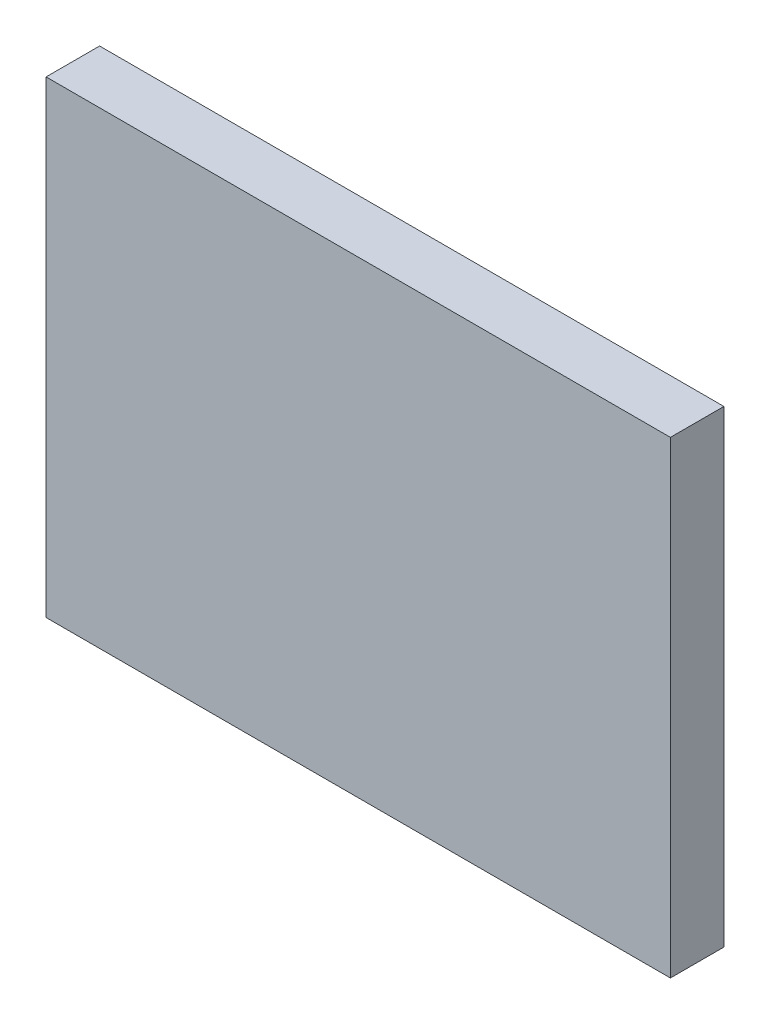
ISO-10303-21;
HEADER;
FILE_DESCRIPTION(('STEP AP214'),'2;1');
FILE_NAME('part.step','',(''),(''),'','','');
FILE_SCHEMA(('AUTOMOTIVE_DESIGN { 1 0 10303 214 1 1 1 1 }'));
ENDSEC;
DATA;
#1=APPLICATION_CONTEXT('core data for automotive mechanical design processes');
#2=APPLICATION_PROTOCOL_DEFINITION('international standard','automotive_design',2000,#1);
#3=PRODUCT_CONTEXT('',#1,'mechanical');
#4=PRODUCT('Part','Part','',(#3));
#5=PRODUCT_RELATED_PRODUCT_CATEGORY('part','',(#4));
#6=PRODUCT_DEFINITION_FORMATION('','',#4);
#7=PRODUCT_DEFINITION_CONTEXT('part definition',#1,'design');
#8=PRODUCT_DEFINITION('design','',#6,#7);
#9=PRODUCT_DEFINITION_SHAPE('','',#8);
#10=(LENGTH_UNIT() NAMED_UNIT(*) SI_UNIT(.MILLI.,.METRE.));
#11=(NAMED_UNIT(*) PLANE_ANGLE_UNIT() SI_UNIT($,.RADIAN.));
#12=(NAMED_UNIT(*) SI_UNIT($,.STERADIAN.) SOLID_ANGLE_UNIT());
#13=UNCERTAINTY_MEASURE_WITH_UNIT(LENGTH_MEASURE(1.E-05),#10,'distance_accuracy_value','');
#14=(GEOMETRIC_REPRESENTATION_CONTEXT(3) GLOBAL_UNCERTAINTY_ASSIGNED_CONTEXT((#13)) GLOBAL_UNIT_ASSIGNED_CONTEXT((#10,
#11,#12)) REPRESENTATION_CONTEXT('',''));
#15=CARTESIAN_POINT('',(0.,0.,0.));
#16=DIRECTION('',(0.,0.,1.));
#17=DIRECTION('',(1.,0.,0.));
#18=AXIS2_PLACEMENT_3D('',#15,#16,#17);
#19=CARTESIAN_POINT('',(2.28346,3.36364,0.76487));
#20=DIRECTION('',(0.,0.,-1.));
#21=DIRECTION('',(0.,1.,0.));
#22=AXIS2_PLACEMENT_3D('',#19,#20,#21);
#23=PLANE('',#22);
#24=DIRECTION('',(1.,0.,0.));
#25=VECTOR('',#24,1.);
#26=CARTESIAN_POINT('',(2.08346,3.51364,0.76487));
#27=LINE('',#26,#25);
#28=CARTESIAN_POINT('',(2.08346,3.51364,0.76487));
#29=VERTEX_POINT('',#28);
#30=CARTESIAN_POINT('',(2.48346,3.51364,0.76487));
#31=VERTEX_POINT('',#30);
#32=EDGE_CURVE('E55',#29,#31,#27,.T.);
#33=ORIENTED_EDGE('',*,*,#32,.T.);
#34=DIRECTION('',(0.,1.,0.));
#35=VECTOR('',#34,1.);
#36=CARTESIAN_POINT('',(2.48346,3.51364,0.76487));
#37=LINE('',#36,#35);
#38=CARTESIAN_POINT('',(2.48346,3.21364,0.76487));
#39=VERTEX_POINT('',#38);
#40=EDGE_CURVE('E57',#31,#39,#37,.F.);
#41=ORIENTED_EDGE('',*,*,#40,.T.);
#42=DIRECTION('',(1.,0.,0.));
#43=VECTOR('',#42,1.);
#44=CARTESIAN_POINT('',(2.48346,3.21364,0.76487));
#45=LINE('',#44,#43);
#46=CARTESIAN_POINT('',(2.08346,3.21364,0.76487));
#47=VERTEX_POINT('',#46);
#48=EDGE_CURVE('E20',#39,#47,#45,.F.);
#49=ORIENTED_EDGE('',*,*,#48,.T.);
#50=DIRECTION('',(0.,1.,0.));
#51=VECTOR('',#50,1.);
#52=CARTESIAN_POINT('',(2.08346,3.21364,0.76487));
#53=LINE('',#52,#51);
#54=EDGE_CURVE('E80',#47,#29,#53,.T.);
#55=ORIENTED_EDGE('',*,*,#54,.T.);
#56=EDGE_LOOP('',(#33,#41,#49,#55));
#57=FACE_BOUND('',#56,.T.);
#58=ADVANCED_FACE('F17',(#57),#23,.T.);
#59=CARTESIAN_POINT('',(2.48346,3.21364,0.76487));
#60=DIRECTION('',(0.,1.,0.));
#61=DIRECTION('',(0.,0.,1.));
#62=AXIS2_PLACEMENT_3D('',#59,#60,#61);
#63=PLANE('',#62);
#64=DIRECTION('',(0.,0.,1.));
#65=VECTOR('',#64,1.);
#66=CARTESIAN_POINT('',(2.08346,3.21364,0.76487));
#67=LINE('',#66,#65);
#68=CARTESIAN_POINT('',(2.08346,3.21364,0.79916));
#69=VERTEX_POINT('',#68);
#70=EDGE_CURVE('E68',#69,#47,#67,.F.);
#71=ORIENTED_EDGE('',*,*,#70,.T.);
#72=ORIENTED_EDGE('',*,*,#48,.F.);
#73=DIRECTION('',(0.,0.,1.));
#74=VECTOR('',#73,1.);
#75=CARTESIAN_POINT('',(2.48346,3.21364,0.76487));
#76=LINE('',#75,#74);
#77=CARTESIAN_POINT('',(2.48346,3.21364,0.79916));
#78=VERTEX_POINT('',#77);
#79=EDGE_CURVE('E63',#39,#78,#76,.T.);
#80=ORIENTED_EDGE('',*,*,#79,.T.);
#81=DIRECTION('',(1.,0.,0.));
#82=VECTOR('',#81,1.);
#83=CARTESIAN_POINT('',(2.28346,3.21364,0.79916));
#84=LINE('',#83,#82);
#85=EDGE_CURVE('E83',#69,#78,#84,.T.);
#86=ORIENTED_EDGE('',*,*,#85,.F.);
#87=EDGE_LOOP('',(#71,#72,#80,#86));
#88=FACE_BOUND('',#87,.T.);
#89=ADVANCED_FACE('F65',(#88),#63,.F.);
#90=CARTESIAN_POINT('',(2.48346,3.51364,0.76487));
#91=DIRECTION('',(-1.,0.,0.));
#92=DIRECTION('',(0.,0.,1.));
#93=AXIS2_PLACEMENT_3D('',#90,#91,#92);
#94=PLANE('',#93);
#95=ORIENTED_EDGE('',*,*,#79,.F.);
#96=ORIENTED_EDGE('',*,*,#40,.F.);
#97=DIRECTION('',(0.,0.,-1.));
#98=VECTOR('',#97,1.);
#99=CARTESIAN_POINT('',(2.48346,3.51364,0.76487));
#100=LINE('',#99,#98);
#101=CARTESIAN_POINT('',(2.48346,3.51364,0.79916));
#102=VERTEX_POINT('',#101);
#103=EDGE_CURVE('E75',#31,#102,#100,.F.);
#104=ORIENTED_EDGE('',*,*,#103,.T.);
#105=DIRECTION('',(0.,-1.,0.));
#106=VECTOR('',#105,1.);
#107=CARTESIAN_POINT('',(2.48346,3.36364,0.79916));
#108=LINE('',#107,#106);
#109=EDGE_CURVE('E72',#78,#102,#108,.F.);
#110=ORIENTED_EDGE('',*,*,#109,.F.);
#111=EDGE_LOOP('',(#95,#96,#104,#110));
#112=FACE_BOUND('',#111,.T.);
#113=ADVANCED_FACE('F70',(#112),#94,.F.);
#114=CARTESIAN_POINT('',(2.08346,3.51364,0.76487));
#115=DIRECTION('',(0.,-1.,0.));
#116=DIRECTION('',(0.,0.,-1.));
#117=AXIS2_PLACEMENT_3D('',#114,#115,#116);
#118=PLANE('',#117);
#119=ORIENTED_EDGE('',*,*,#103,.F.);
#120=ORIENTED_EDGE('',*,*,#32,.F.);
#121=DIRECTION('',(0.,0.,1.));
#122=VECTOR('',#121,1.);
#123=CARTESIAN_POINT('',(2.08346,3.51364,0.76487));
#124=LINE('',#123,#122);
#125=CARTESIAN_POINT('',(2.08346,3.51364,0.79916));
#126=VERTEX_POINT('',#125);
#127=EDGE_CURVE('E35',#29,#126,#124,.T.);
#128=ORIENTED_EDGE('',*,*,#127,.T.);
#129=DIRECTION('',(1.,0.,0.));
#130=VECTOR('',#129,1.);
#131=CARTESIAN_POINT('',(2.28346,3.51364,0.79916));
#132=LINE('',#131,#130);
#133=EDGE_CURVE('E26',#102,#126,#132,.F.);
#134=ORIENTED_EDGE('',*,*,#133,.F.);
#135=EDGE_LOOP('',(#119,#120,#128,#134));
#136=FACE_BOUND('',#135,.T.);
#137=ADVANCED_FACE('F89',(#136),#118,.F.);
#138=CARTESIAN_POINT('',(2.08346,3.21364,0.76487));
#139=DIRECTION('',(1.,0.,0.));
#140=DIRECTION('',(0.,1.,0.));
#141=AXIS2_PLACEMENT_3D('',#138,#139,#140);
#142=PLANE('',#141);
#143=ORIENTED_EDGE('',*,*,#127,.F.);
#144=ORIENTED_EDGE('',*,*,#54,.F.);
#145=ORIENTED_EDGE('',*,*,#70,.F.);
#146=DIRECTION('',(0.,-1.,0.));
#147=VECTOR('',#146,1.);
#148=CARTESIAN_POINT('',(2.08346,3.36364,0.79916));
#149=LINE('',#148,#147);
#150=EDGE_CURVE('E11',#126,#69,#149,.T.);
#151=ORIENTED_EDGE('',*,*,#150,.F.);
#152=EDGE_LOOP('',(#143,#144,#145,#151));
#153=FACE_BOUND('',#152,.T.);
#154=ADVANCED_FACE('F91',(#153),#142,.F.);
#155=CARTESIAN_POINT('',(2.28346,3.36364,0.79916));
#156=DIRECTION('',(0.,0.,1.));
#157=DIRECTION('',(0.,-1.,0.));
#158=AXIS2_PLACEMENT_3D('',#155,#156,#157);
#159=PLANE('',#158);
#160=ORIENTED_EDGE('',*,*,#133,.T.);
#161=ORIENTED_EDGE('',*,*,#150,.T.);
#162=ORIENTED_EDGE('',*,*,#85,.T.);
#163=ORIENTED_EDGE('',*,*,#109,.T.);
#164=EDGE_LOOP('',(#160,#161,#162,#163));
#165=FACE_BOUND('',#164,.T.);
#166=ADVANCED_FACE('F88',(#165),#159,.T.);
#167=CLOSED_SHELL('',(#58,#89,#113,#137,#154,#166));
#168=MANIFOLD_SOLID_BREP('B1',#167);
#169=ADVANCED_BREP_SHAPE_REPRESENTATION('',(#18,#168),#14);
#170=SHAPE_DEFINITION_REPRESENTATION(#9,#169);
ENDSEC;
END-ISO-10303-21;
